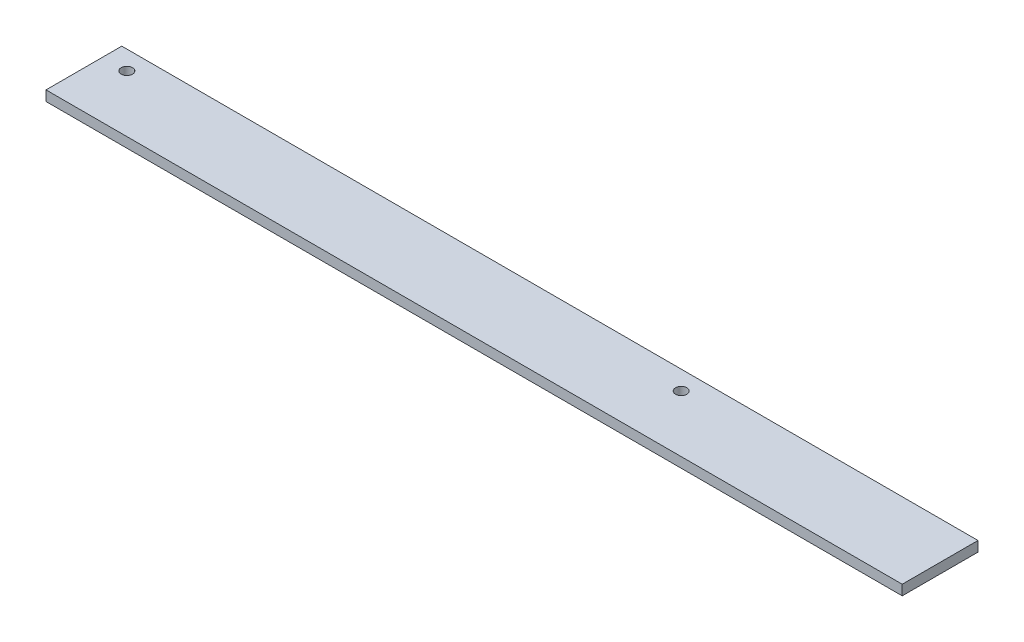
ISO-10303-21;
HEADER;
FILE_DESCRIPTION(('STEP AP214'),'2;1');
FILE_NAME('part.step','',(''),(''),'','','');
FILE_SCHEMA(('AUTOMOTIVE_DESIGN { 1 0 10303 214 1 1 1 1 }'));
ENDSEC;
DATA;
#1=APPLICATION_CONTEXT('core data for automotive mechanical design processes');
#2=APPLICATION_PROTOCOL_DEFINITION('international standard','automotive_design',2000,#1);
#3=PRODUCT_CONTEXT('',#1,'mechanical');
#4=PRODUCT('Part','Part','',(#3));
#5=PRODUCT_RELATED_PRODUCT_CATEGORY('part','',(#4));
#6=PRODUCT_DEFINITION_FORMATION('','',#4);
#7=PRODUCT_DEFINITION_CONTEXT('part definition',#1,'design');
#8=PRODUCT_DEFINITION('design','',#6,#7);
#9=PRODUCT_DEFINITION_SHAPE('','',#8);
#10=(LENGTH_UNIT() NAMED_UNIT(*) SI_UNIT(.MILLI.,.METRE.));
#11=(NAMED_UNIT(*) PLANE_ANGLE_UNIT() SI_UNIT($,.RADIAN.));
#12=(NAMED_UNIT(*) SI_UNIT($,.STERADIAN.) SOLID_ANGLE_UNIT());
#13=UNCERTAINTY_MEASURE_WITH_UNIT(LENGTH_MEASURE(1.E-05),#10,'distance_accuracy_value','');
#14=(GEOMETRIC_REPRESENTATION_CONTEXT(3) GLOBAL_UNCERTAINTY_ASSIGNED_CONTEXT((#13)) GLOBAL_UNIT_ASSIGNED_CONTEXT((#10,
#11,#12)) REPRESENTATION_CONTEXT('',''));
#15=CARTESIAN_POINT('',(0.,0.,0.));
#16=DIRECTION('',(0.,0.,1.));
#17=DIRECTION('',(1.,0.,0.));
#18=AXIS2_PLACEMENT_3D('',#15,#16,#17);
#19=CARTESIAN_POINT('',(339.,-2.,-15.));
#20=DIRECTION('',(0.,0.,1.));
#21=DIRECTION('',(1.,0.,0.));
#22=AXIS2_PLACEMENT_3D('',#19,#20,#21);
#23=PLANE('',#22);
#24=DIRECTION('',(0.,1.,0.));
#25=VECTOR('',#24,1.);
#26=CARTESIAN_POINT('',(0.,-2.,-15.));
#27=LINE('',#26,#25);
#28=CARTESIAN_POINT('',(0.,-2.,-15.));
#29=VERTEX_POINT('',#28);
#30=CARTESIAN_POINT('',(0.,2.,-15.));
#31=VERTEX_POINT('',#30);
#32=EDGE_CURVE('E99',#29,#31,#27,.T.);
#33=ORIENTED_EDGE('',*,*,#32,.T.);
#34=DIRECTION('',(-1.,0.,0.));
#35=VECTOR('',#34,1.);
#36=CARTESIAN_POINT('',(339.,2.,-15.));
#37=LINE('',#36,#35);
#38=CARTESIAN_POINT('',(339.,2.,-15.));
#39=VERTEX_POINT('',#38);
#40=EDGE_CURVE('E11',#39,#31,#37,.T.);
#41=ORIENTED_EDGE('',*,*,#40,.F.);
#42=DIRECTION('',(0.,1.,0.));
#43=VECTOR('',#42,1.);
#44=CARTESIAN_POINT('',(339.,-2.,-15.));
#45=LINE('',#44,#43);
#46=CARTESIAN_POINT('',(339.,-2.,-15.));
#47=VERTEX_POINT('',#46);
#48=EDGE_CURVE('E87',#47,#39,#45,.T.);
#49=ORIENTED_EDGE('',*,*,#48,.F.);
#50=DIRECTION('',(-1.,0.,0.));
#51=VECTOR('',#50,1.);
#52=CARTESIAN_POINT('',(339.,-2.,-15.));
#53=LINE('',#52,#51);
#54=EDGE_CURVE('E95',#47,#29,#53,.T.);
#55=ORIENTED_EDGE('',*,*,#54,.T.);
#56=EDGE_LOOP('',(#33,#41,#49,#55));
#57=FACE_BOUND('',#56,.T.);
#58=ADVANCED_FACE('F36',(#57),#23,.F.);
#59=CARTESIAN_POINT('',(339.,2.,15.));
#60=DIRECTION('',(0.,-1.,0.));
#61=DIRECTION('',(0.,0.,-1.));
#62=AXIS2_PLACEMENT_3D('',#59,#60,#61);
#63=PLANE('',#62);
#64=CARTESIAN_POINT('',(9.49999999999999,2.,-7.5));
#65=DIRECTION('',(0.,1.,0.));
#66=DIRECTION('',(0.,0.,1.));
#67=AXIS2_PLACEMENT_3D('',#64,#65,#66);
#68=CIRCLE('',#67,2.25);
#69=CARTESIAN_POINT('',(9.49999999999999,2.,-5.25000000000001));
#70=VERTEX_POINT('',#69);
#71=EDGE_CURVE('E119',#70,#70,#68,.T.);
#72=ORIENTED_EDGE('',*,*,#71,.F.);
#73=EDGE_LOOP('',(#72));
#74=FACE_BOUND('',#73,.T.);
#75=CARTESIAN_POINT('',(229.,2.,-7.5));
#76=DIRECTION('',(0.,1.,0.));
#77=DIRECTION('',(0.,0.,1.));
#78=AXIS2_PLACEMENT_3D('',#75,#76,#77);
#79=CIRCLE('',#78,2.24999999999995);
#80=CARTESIAN_POINT('',(229.,2.,-5.25000000000005));
#81=VERTEX_POINT('',#80);
#82=EDGE_CURVE('E113',#81,#81,#79,.T.);
#83=ORIENTED_EDGE('',*,*,#82,.F.);
#84=EDGE_LOOP('',(#83));
#85=FACE_BOUND('',#84,.T.);
#86=DIRECTION('',(0.,0.,1.));
#87=VECTOR('',#86,1.);
#88=CARTESIAN_POINT('',(0.,2.,15.));
#89=LINE('',#88,#87);
#90=CARTESIAN_POINT('',(0.,2.,15.));
#91=VERTEX_POINT('',#90);
#92=EDGE_CURVE('E91',#31,#91,#89,.T.);
#93=ORIENTED_EDGE('',*,*,#92,.T.);
#94=DIRECTION('',(-1.,0.,0.));
#95=VECTOR('',#94,1.);
#96=CARTESIAN_POINT('',(339.,2.,15.));
#97=LINE('',#96,#95);
#98=CARTESIAN_POINT('',(339.,2.,15.));
#99=VERTEX_POINT('',#98);
#100=EDGE_CURVE('E44',#99,#91,#97,.T.);
#101=ORIENTED_EDGE('',*,*,#100,.F.);
#102=DIRECTION('',(0.,0.,1.));
#103=VECTOR('',#102,1.);
#104=CARTESIAN_POINT('',(339.,2.,15.));
#105=LINE('',#104,#103);
#106=EDGE_CURVE('E82',#39,#99,#105,.T.);
#107=ORIENTED_EDGE('',*,*,#106,.F.);
#108=ORIENTED_EDGE('',*,*,#40,.T.);
#109=EDGE_LOOP('',(#93,#101,#107,#108));
#110=FACE_BOUND('',#109,.T.);
#111=ADVANCED_FACE('F90',(#74,#85,#110),#63,.F.);
#112=CARTESIAN_POINT('',(339.,-2.,15.));
#113=DIRECTION('',(0.,0.,-1.));
#114=DIRECTION('',(-1.,0.,0.));
#115=AXIS2_PLACEMENT_3D('',#112,#113,#114);
#116=PLANE('',#115);
#117=DIRECTION('',(0.,-1.,0.));
#118=VECTOR('',#117,1.);
#119=CARTESIAN_POINT('',(0.,-2.,15.));
#120=LINE('',#119,#118);
#121=CARTESIAN_POINT('',(0.,-2.,15.));
#122=VERTEX_POINT('',#121);
#123=EDGE_CURVE('E69',#91,#122,#120,.T.);
#124=ORIENTED_EDGE('',*,*,#123,.T.);
#125=DIRECTION('',(-1.,0.,0.));
#126=VECTOR('',#125,1.);
#127=CARTESIAN_POINT('',(339.,-2.,15.));
#128=LINE('',#127,#126);
#129=CARTESIAN_POINT('',(339.,-2.,15.));
#130=VERTEX_POINT('',#129);
#131=EDGE_CURVE('E92',#130,#122,#128,.T.);
#132=ORIENTED_EDGE('',*,*,#131,.F.);
#133=DIRECTION('',(0.,-1.,0.));
#134=VECTOR('',#133,1.);
#135=CARTESIAN_POINT('',(339.,-2.,15.));
#136=LINE('',#135,#134);
#137=EDGE_CURVE('E85',#99,#130,#136,.T.);
#138=ORIENTED_EDGE('',*,*,#137,.F.);
#139=ORIENTED_EDGE('',*,*,#100,.T.);
#140=EDGE_LOOP('',(#124,#132,#138,#139));
#141=FACE_BOUND('',#140,.T.);
#142=ADVANCED_FACE('F93',(#141),#116,.F.);
#143=CARTESIAN_POINT('',(339.,-2.,15.));
#144=DIRECTION('',(0.,1.,0.));
#145=DIRECTION('',(0.,0.,1.));
#146=AXIS2_PLACEMENT_3D('',#143,#144,#145);
#147=PLANE('',#146);
#148=CARTESIAN_POINT('',(9.49999999999999,-2.,-7.5));
#149=DIRECTION('',(0.,1.,0.));
#150=DIRECTION('',(0.,0.,1.));
#151=AXIS2_PLACEMENT_3D('',#148,#149,#150);
#152=CIRCLE('',#151,2.25);
#153=CARTESIAN_POINT('',(9.49999999999999,-2.,-5.25000000000001));
#154=VERTEX_POINT('',#153);
#155=EDGE_CURVE('E102',#154,#154,#152,.T.);
#156=ORIENTED_EDGE('',*,*,#155,.T.);
#157=EDGE_LOOP('',(#156));
#158=FACE_BOUND('',#157,.T.);
#159=CARTESIAN_POINT('',(229.,-2.,-7.5));
#160=DIRECTION('',(0.,1.,0.));
#161=DIRECTION('',(0.,0.,1.));
#162=AXIS2_PLACEMENT_3D('',#159,#160,#161);
#163=CIRCLE('',#162,2.24999999999995);
#164=CARTESIAN_POINT('',(229.,-2.,-5.25000000000005));
#165=VERTEX_POINT('',#164);
#166=EDGE_CURVE('E116',#165,#165,#163,.T.);
#167=ORIENTED_EDGE('',*,*,#166,.T.);
#168=EDGE_LOOP('',(#167));
#169=FACE_BOUND('',#168,.T.);
#170=DIRECTION('',(0.,0.,-1.));
#171=VECTOR('',#170,1.);
#172=CARTESIAN_POINT('',(0.,-2.,15.));
#173=LINE('',#172,#171);
#174=EDGE_CURVE('E75',#122,#29,#173,.T.);
#175=ORIENTED_EDGE('',*,*,#174,.T.);
#176=ORIENTED_EDGE('',*,*,#54,.F.);
#177=DIRECTION('',(0.,0.,-1.));
#178=VECTOR('',#177,1.);
#179=CARTESIAN_POINT('',(339.,-2.,15.));
#180=LINE('',#179,#178);
#181=EDGE_CURVE('E52',#130,#47,#180,.T.);
#182=ORIENTED_EDGE('',*,*,#181,.F.);
#183=ORIENTED_EDGE('',*,*,#131,.T.);
#184=EDGE_LOOP('',(#175,#176,#182,#183));
#185=FACE_BOUND('',#184,.T.);
#186=ADVANCED_FACE('F107',(#158,#169,#185),#147,.F.);
#187=CARTESIAN_POINT('',(339.,0.,0.));
#188=DIRECTION('',(-1.,0.,0.));
#189=DIRECTION('',(0.,0.,1.));
#190=AXIS2_PLACEMENT_3D('',#187,#188,#189);
#191=PLANE('',#190);
#192=ORIENTED_EDGE('',*,*,#48,.T.);
#193=ORIENTED_EDGE('',*,*,#106,.T.);
#194=ORIENTED_EDGE('',*,*,#137,.T.);
#195=ORIENTED_EDGE('',*,*,#181,.T.);
#196=EDGE_LOOP('',(#192,#193,#194,#195));
#197=FACE_BOUND('',#196,.T.);
#198=ADVANCED_FACE('F83',(#197),#191,.F.);
#199=CARTESIAN_POINT('',(0.,0.,0.));
#200=DIRECTION('',(-1.,0.,0.));
#201=DIRECTION('',(0.,0.,1.));
#202=AXIS2_PLACEMENT_3D('',#199,#200,#201);
#203=PLANE('',#202);
#204=ORIENTED_EDGE('',*,*,#32,.F.);
#205=ORIENTED_EDGE('',*,*,#174,.F.);
#206=ORIENTED_EDGE('',*,*,#123,.F.);
#207=ORIENTED_EDGE('',*,*,#92,.F.);
#208=EDGE_LOOP('',(#204,#205,#206,#207));
#209=FACE_BOUND('',#208,.T.);
#210=ADVANCED_FACE('F110',(#209),#203,.T.);
#211=CARTESIAN_POINT('',(229.,-2.,-7.5));
#212=DIRECTION('',(0.,1.,0.));
#213=DIRECTION('',(0.,0.,1.));
#214=AXIS2_PLACEMENT_3D('',#211,#212,#213);
#215=CYLINDRICAL_SURFACE('',#214,2.24999999999995);
#216=ORIENTED_EDGE('',*,*,#166,.F.);
#217=EDGE_LOOP('',(#216));
#218=FACE_BOUND('',#217,.T.);
#219=ORIENTED_EDGE('',*,*,#82,.T.);
#220=EDGE_LOOP('',(#219));
#221=FACE_BOUND('',#220,.T.);
#222=ADVANCED_FACE('F130',(#218,#221),#215,.F.);
#223=CARTESIAN_POINT('',(9.49999999999999,-2.,-7.5));
#224=DIRECTION('',(0.,1.,0.));
#225=DIRECTION('',(0.,0.,1.));
#226=AXIS2_PLACEMENT_3D('',#223,#224,#225);
#227=CYLINDRICAL_SURFACE('',#226,2.25);
#228=ORIENTED_EDGE('',*,*,#155,.F.);
#229=EDGE_LOOP('',(#228));
#230=FACE_BOUND('',#229,.T.);
#231=ORIENTED_EDGE('',*,*,#71,.T.);
#232=EDGE_LOOP('',(#231));
#233=FACE_BOUND('',#232,.T.);
#234=ADVANCED_FACE('F127',(#230,#233),#227,.F.);
#235=CLOSED_SHELL('',(#58,#111,#142,#186,#198,#210,#222,#234));
#236=MANIFOLD_SOLID_BREP('B2',#235);
#237=ADVANCED_BREP_SHAPE_REPRESENTATION('',(#18,#236),#14);
#238=SHAPE_DEFINITION_REPRESENTATION(#9,#237);
ENDSEC;
END-ISO-10303-21;
